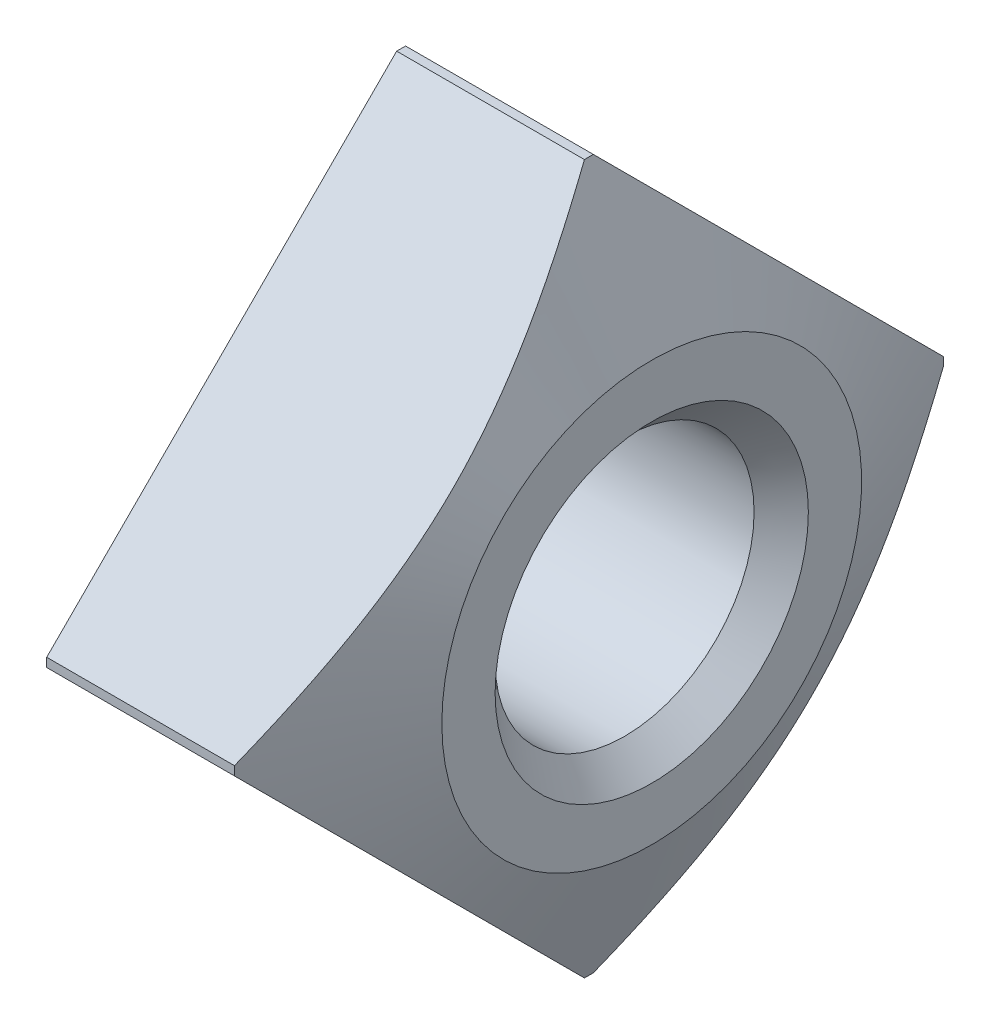
ISO-10303-21;
HEADER;
FILE_DESCRIPTION(('STEP AP214'),'2;1');
FILE_NAME('part.step','',(''),(''),'','','');
FILE_SCHEMA(('AUTOMOTIVE_DESIGN { 1 0 10303 214 1 1 1 1 }'));
ENDSEC;
DATA;
#1=APPLICATION_CONTEXT('core data for automotive mechanical design processes');
#2=APPLICATION_PROTOCOL_DEFINITION('international standard','automotive_design',2000,#1);
#3=PRODUCT_CONTEXT('',#1,'mechanical');
#4=PRODUCT('Part','Part','',(#3));
#5=PRODUCT_RELATED_PRODUCT_CATEGORY('part','',(#4));
#6=PRODUCT_DEFINITION_FORMATION('','',#4);
#7=PRODUCT_DEFINITION_CONTEXT('part definition',#1,'design');
#8=PRODUCT_DEFINITION('design','',#6,#7);
#9=PRODUCT_DEFINITION_SHAPE('','',#8);
#10=(LENGTH_UNIT() NAMED_UNIT(*) SI_UNIT(.MILLI.,.METRE.));
#11=(NAMED_UNIT(*) PLANE_ANGLE_UNIT() SI_UNIT($,.RADIAN.));
#12=(NAMED_UNIT(*) SI_UNIT($,.STERADIAN.) SOLID_ANGLE_UNIT());
#13=UNCERTAINTY_MEASURE_WITH_UNIT(LENGTH_MEASURE(1.E-05),#10,'distance_accuracy_value','');
#14=(GEOMETRIC_REPRESENTATION_CONTEXT(3) GLOBAL_UNCERTAINTY_ASSIGNED_CONTEXT((#13)) GLOBAL_UNIT_ASSIGNED_CONTEXT((#10,
#11,#12)) REPRESENTATION_CONTEXT('',''));
#15=CARTESIAN_POINT('',(0.,0.,0.));
#16=DIRECTION('',(0.,0.,1.));
#17=DIRECTION('',(1.,0.,0.));
#18=AXIS2_PLACEMENT_3D('',#15,#16,#17);
#19=CARTESIAN_POINT('',(4.,0.,0.));
#20=DIRECTION('',(-1.,0.,0.));
#21=DIRECTION('',(0.,0.,1.));
#22=AXIS2_PLACEMENT_3D('',#19,#20,#21);
#23=CYLINDRICAL_SURFACE('',#22,5.6568542494924);
#24=CARTESIAN_POINT('',(2.9969512250895,0.,0.));
#25=DIRECTION('',(-1.,0.,0.));
#26=DIRECTION('',(0.,0.,1.));
#27=AXIS2_PLACEMENT_3D('',#24,#25,#26);
#28=CIRCLE('',#27,5.6568542494924);
#29=CARTESIAN_POINT('',(2.9969512250895,-0.0711582499163105,5.65640667769469));
#30=VERTEX_POINT('',#29);
#31=CARTESIAN_POINT('',(2.9969512250895,0.0711582499163112,5.65640667769469));
#32=VERTEX_POINT('',#31);
#33=EDGE_CURVE('E145',#30,#32,#28,.T.);
#34=ORIENTED_EDGE('',*,*,#33,.T.);
#35=DIRECTION('',(-1.,0.,0.));
#36=VECTOR('',#35,1.);
#37=CARTESIAN_POINT('',(4.,0.0711582499163094,5.65640667769469));
#38=LINE('',#37,#36);
#39=CARTESIAN_POINT('',(0.,0.071158249916309,5.65640667769469));
#40=VERTEX_POINT('',#39);
#41=EDGE_CURVE('E198',#32,#40,#38,.T.);
#42=ORIENTED_EDGE('',*,*,#41,.T.);
#43=CARTESIAN_POINT('',(0.,0.,0.));
#44=DIRECTION('',(-1.,0.,0.));
#45=DIRECTION('',(0.,0.,1.));
#46=AXIS2_PLACEMENT_3D('',#43,#44,#45);
#47=CIRCLE('',#46,5.6568542494924);
#48=CARTESIAN_POINT('',(0.,-0.0711582499163096,5.65640667769469));
#49=VERTEX_POINT('',#48);
#50=EDGE_CURVE('E140',#49,#40,#47,.T.);
#51=ORIENTED_EDGE('',*,*,#50,.F.);
#52=DIRECTION('',(-1.,0.,0.));
#53=VECTOR('',#52,1.);
#54=CARTESIAN_POINT('',(4.,-0.0711582499163094,5.65640667769469));
#55=LINE('',#54,#53);
#56=EDGE_CURVE('E206',#49,#30,#55,.F.);
#57=ORIENTED_EDGE('',*,*,#56,.T.);
#58=EDGE_LOOP('',(#34,#42,#51,#57));
#59=FACE_BOUND('',#58,.T.);
#60=ADVANCED_FACE('F43',(#59),#23,.T.);
#61=CARTESIAN_POINT('',(2.9969512250895,-5.65640667769469,-0.0711582499163105));
#62=VERTEX_POINT('',#61);
#63=CARTESIAN_POINT('',(2.9969512250895,-5.65640667769469,0.0711582499163112));
#64=VERTEX_POINT('',#63);
#65=EDGE_CURVE('E188',#62,#64,#28,.T.);
#66=ORIENTED_EDGE('',*,*,#65,.T.);
#67=DIRECTION('',(-1.,0.,0.));
#68=VECTOR('',#67,1.);
#69=CARTESIAN_POINT('',(4.,-5.65640667769469,0.0711582499163094));
#70=LINE('',#69,#68);
#71=CARTESIAN_POINT('',(0.,-5.65640667769469,0.071158249916309));
#72=VERTEX_POINT('',#71);
#73=EDGE_CURVE('E64',#64,#72,#70,.T.);
#74=ORIENTED_EDGE('',*,*,#73,.T.);
#75=CARTESIAN_POINT('',(0.,-5.65640667769469,-0.0711582499163096));
#76=VERTEX_POINT('',#75);
#77=EDGE_CURVE('E138',#76,#72,#47,.T.);
#78=ORIENTED_EDGE('',*,*,#77,.F.);
#79=DIRECTION('',(-1.,0.,0.));
#80=VECTOR('',#79,1.);
#81=CARTESIAN_POINT('',(4.,-5.65640667769469,-0.0711582499163094));
#82=LINE('',#81,#80);
#83=EDGE_CURVE('E209',#76,#62,#82,.F.);
#84=ORIENTED_EDGE('',*,*,#83,.T.);
#85=EDGE_LOOP('',(#66,#74,#78,#84));
#86=FACE_BOUND('',#85,.T.);
#87=ADVANCED_FACE('F242',(#86),#23,.T.);
#88=CARTESIAN_POINT('',(2.9969512250895,0.0711582499163105,-5.65640667769469));
#89=VERTEX_POINT('',#88);
#90=CARTESIAN_POINT('',(2.9969512250895,-0.0711582499163112,-5.65640667769469));
#91=VERTEX_POINT('',#90);
#92=EDGE_CURVE('E187',#89,#91,#28,.T.);
#93=ORIENTED_EDGE('',*,*,#92,.T.);
#94=DIRECTION('',(-1.,0.,0.));
#95=VECTOR('',#94,1.);
#96=CARTESIAN_POINT('',(4.,-0.0711582499163094,-5.65640667769469));
#97=LINE('',#96,#95);
#98=CARTESIAN_POINT('',(0.,-0.071158249916309,-5.65640667769469));
#99=VERTEX_POINT('',#98);
#100=EDGE_CURVE('E72',#91,#99,#97,.T.);
#101=ORIENTED_EDGE('',*,*,#100,.T.);
#102=CARTESIAN_POINT('',(0.,0.0711582499163096,-5.65640667769469));
#103=VERTEX_POINT('',#102);
#104=EDGE_CURVE('E131',#103,#99,#47,.T.);
#105=ORIENTED_EDGE('',*,*,#104,.F.);
#106=DIRECTION('',(-1.,0.,0.));
#107=VECTOR('',#106,1.);
#108=CARTESIAN_POINT('',(4.,0.0711582499163094,-5.65640667769469));
#109=LINE('',#108,#107);
#110=EDGE_CURVE('E113',#103,#89,#109,.F.);
#111=ORIENTED_EDGE('',*,*,#110,.T.);
#112=EDGE_LOOP('',(#93,#101,#105,#111));
#113=FACE_BOUND('',#112,.T.);
#114=ADVANCED_FACE('F137',(#113),#23,.T.);
#115=CARTESIAN_POINT('',(0.,0.,0.));
#116=DIRECTION('',(1.,0.,0.));
#117=DIRECTION('',(0.,0.,-1.));
#118=AXIS2_PLACEMENT_3D('',#115,#116,#117);
#119=PLANE('',#118);
#120=CARTESIAN_POINT('',(0.,0.,0.));
#121=DIRECTION('',(-1.,0.,0.));
#122=DIRECTION('',(0.,0.,1.));
#123=AXIS2_PLACEMENT_3D('',#120,#121,#122);
#124=CIRCLE('',#123,2.5);
#125=CARTESIAN_POINT('',(0.,0.,2.5));
#126=VERTEX_POINT('',#125);
#127=EDGE_CURVE('E217',#126,#126,#124,.T.);
#128=ORIENTED_EDGE('',*,*,#127,.F.);
#129=EDGE_LOOP('',(#128));
#130=FACE_BOUND('',#129,.T.);
#131=ORIENTED_EDGE('',*,*,#50,.T.);
#132=DIRECTION('',(0.,-0.707106781186548,0.707106781186548));
#133=VECTOR('',#132,1.);
#134=CARTESIAN_POINT('',(0.,5.727564927611,0.));
#135=LINE('',#134,#133);
#136=CARTESIAN_POINT('',(0.,5.65640667769469,0.0711582499163096));
#137=VERTEX_POINT('',#136);
#138=EDGE_CURVE('E215',#137,#40,#135,.T.);
#139=ORIENTED_EDGE('',*,*,#138,.F.);
#140=CARTESIAN_POINT('',(0.,5.65640667769469,-0.071158249916309));
#141=VERTEX_POINT('',#140);
#142=EDGE_CURVE('E134',#137,#141,#47,.T.);
#143=ORIENTED_EDGE('',*,*,#142,.T.);
#144=DIRECTION('',(0.,0.707106781186548,0.707106781186548));
#145=VECTOR('',#144,1.);
#146=CARTESIAN_POINT('',(0.,0.,-5.727564927611));
#147=LINE('',#146,#145);
#148=EDGE_CURVE('E116',#103,#141,#147,.T.);
#149=ORIENTED_EDGE('',*,*,#148,.F.);
#150=ORIENTED_EDGE('',*,*,#104,.T.);
#151=DIRECTION('',(0.,0.707106781186548,-0.707106781186548));
#152=VECTOR('',#151,1.);
#153=CARTESIAN_POINT('',(0.,-5.727564927611,0.));
#154=LINE('',#153,#152);
#155=EDGE_CURVE('E135',#76,#99,#154,.T.);
#156=ORIENTED_EDGE('',*,*,#155,.F.);
#157=ORIENTED_EDGE('',*,*,#77,.T.);
#158=DIRECTION('',(0.,-0.707106781186548,-0.707106781186548));
#159=VECTOR('',#158,1.);
#160=CARTESIAN_POINT('',(0.,0.,5.727564927611));
#161=LINE('',#160,#159);
#162=EDGE_CURVE('E213',#49,#72,#161,.T.);
#163=ORIENTED_EDGE('',*,*,#162,.F.);
#164=EDGE_LOOP('',(#131,#139,#143,#149,#150,#156,#157,#163));
#165=FACE_BOUND('',#164,.T.);
#166=ADVANCED_FACE('F45',(#130,#165),#119,.F.);
#167=ORIENTED_EDGE('',*,*,#142,.F.);
#168=DIRECTION('',(-1.,0.,0.));
#169=VECTOR('',#168,1.);
#170=CARTESIAN_POINT('',(4.,5.65640667769469,0.0711582499163094));
#171=LINE('',#170,#169);
#172=CARTESIAN_POINT('',(2.9969512250895,5.65640667769469,0.0711582499163105));
#173=VERTEX_POINT('',#172);
#174=EDGE_CURVE('E200',#137,#173,#171,.F.);
#175=ORIENTED_EDGE('',*,*,#174,.T.);
#176=CARTESIAN_POINT('',(2.9969512250895,5.65640667769469,-0.0711582499163112));
#177=VERTEX_POINT('',#176);
#178=EDGE_CURVE('E144',#173,#177,#28,.T.);
#179=ORIENTED_EDGE('',*,*,#178,.T.);
#180=DIRECTION('',(-1.,0.,0.));
#181=VECTOR('',#180,1.);
#182=CARTESIAN_POINT('',(4.,5.65640667769469,-0.0711582499163094));
#183=LINE('',#182,#181);
#184=EDGE_CURVE('E124',#177,#141,#183,.T.);
#185=ORIENTED_EDGE('',*,*,#184,.T.);
#186=EDGE_LOOP('',(#167,#175,#179,#185));
#187=FACE_BOUND('',#186,.T.);
#188=ADVANCED_FACE('F243',(#187),#23,.T.);
#189=CARTESIAN_POINT('',(4.,0.,0.));
#190=DIRECTION('',(-1.,0.,0.));
#191=DIRECTION('',(0.,0.,1.));
#192=AXIS2_PLACEMENT_3D('',#189,#190,#191);
#193=CONICAL_SURFACE('',#192,3.35,1.16064395257623);
#194=ORIENTED_EDGE('',*,*,#178,.F.);
#195=CARTESIAN_POINT('',(2.9967512250895,5.65687252332793,0.070692404283066));
#196=CARTESIAN_POINT('',(3.04815610003317,5.53707357547985,0.190491352131148));
#197=CARTESIAN_POINT('',(3.09806790678389,5.41693917093606,0.310625756674938));
#198=CARTESIAN_POINT('',(3.19406203127136,5.17585022127511,0.551714706335886));
#199=CARTESIAN_POINT('',(3.24014256742266,5.05489532258245,0.672669605028545));
#200=CARTESIAN_POINT('',(3.32785305512325,4.81137325286286,0.916191674748142));
#201=CARTESIAN_POINT('',(3.36945360245624,4.68880073438235,1.03876419322865));
#202=CARTESIAN_POINT('',(3.44675752103648,4.44273499107437,1.28482993653663));
#203=CARTESIAN_POINT('',(3.48246158217204,4.31924187572615,1.40832305188485));
#204=CARTESIAN_POINT('',(3.54571574687495,4.07524551982358,1.65231940778742));
#205=CARTESIAN_POINT('',(3.57348827565138,3.95477145228134,1.77279347532966));
#206=CARTESIAN_POINT('',(3.62117839685476,3.71303779453289,2.01452713307811));
#207=CARTESIAN_POINT('',(3.64109607752598,3.59177821316699,2.13578671444401));
#208=CARTESIAN_POINT('',(3.67201509782098,3.3490531768503,2.3785117507607));
#209=CARTESIAN_POINT('',(3.68304330833951,3.22758946295403,2.49997546465697));
#210=CARTESIAN_POINT('',(3.69564386195821,2.98441725461118,2.74314767299982));
#211=CARTESIAN_POINT('',(3.69721664246266,2.86270877174805,2.86485615586295));
#212=CARTESIAN_POINT('',(3.69107458575418,2.62932693622936,3.09823799138164));
#213=CARTESIAN_POINT('',(3.68410555337613,2.51764339122152,3.20992153638948));
#214=CARTESIAN_POINT('',(3.66247203642502,2.29465826955613,3.43290665805487));
#215=CARTESIAN_POINT('',(3.64780743782444,2.183356698583,3.544208229028));
#216=CARTESIAN_POINT('',(3.59315085985838,1.84973815061871,3.87782677699229));
#217=CARTESIAN_POINT('',(3.54251669010606,1.62827392925037,4.09929099836063));
#218=CARTESIAN_POINT('',(3.44971809521995,1.29511691697196,4.43244801063903));
#219=CARTESIAN_POINT('',(3.41534725648814,1.18225562158866,4.54530930602234));
#220=CARTESIAN_POINT('',(3.34190210702859,0.957283095022142,4.77028183258886));
#221=CARTESIAN_POINT('',(3.30282740857889,0.845171926474221,4.88239300113678));
#222=CARTESIAN_POINT('',(3.22102785462997,0.622286456978046,5.10527847063295));
#223=CARTESIAN_POINT('',(3.17832432040565,0.511508193037542,5.21605673457346));
#224=CARTESIAN_POINT('',(3.08975125799081,0.290624355609998,5.436940572001));
#225=CARTESIAN_POINT('',(3.04388278388252,0.180518571325549,5.54704635628545));
#226=CARTESIAN_POINT('',(2.9967512250895,0.0706924042830657,5.65687252332793));
#227=B_SPLINE_CURVE_WITH_KNOTS('',3,(#195,#196,#197,#198,#199,#200,#201,#202,#203,#204,#205,
#206,#207,#208,#209,#210,#211,#212,#213,#214,#215,#216,#217,#218,#219,#220,#221,#222,#223,#224,
#225,#226),.UNSPECIFIED.,.F.,.F.,(4,2,2,2,2,2,2,2,2,2,2,2,2,2,2,4),(0.,0.531168174989741,
1.06258198378602,1.59729471186651,2.13194483421963,2.64966257359643,3.16737449657434,
3.68351556024275,4.1996327472551,4.67372576977668,5.14782581727562,6.09842110234493,
6.58818845486339,7.07799620479323,7.56510240178404,8.05204714404511),.UNSPECIFIED.);
#228=EDGE_CURVE('E11',#173,#32,#227,.T.);
#229=ORIENTED_EDGE('',*,*,#228,.T.);
#230=ORIENTED_EDGE('',*,*,#33,.F.);
#231=CARTESIAN_POINT('',(2.9967512250895,-0.070692404283066,5.65687252332793));
#232=CARTESIAN_POINT('',(3.04815610003317,-0.190491352131148,5.53707357547985));
#233=CARTESIAN_POINT('',(3.09806790678389,-0.310625756674938,5.41693917093606));
#234=CARTESIAN_POINT('',(3.19406203127136,-0.551714706335886,5.17585022127511));
#235=CARTESIAN_POINT('',(3.24014256742266,-0.672669605028545,5.05489532258245));
#236=CARTESIAN_POINT('',(3.32785305512325,-0.916191674748142,4.81137325286286));
#237=CARTESIAN_POINT('',(3.36945360245624,-1.03876419322865,4.68880073438235));
#238=CARTESIAN_POINT('',(3.44675752103648,-1.28482993653663,4.44273499107437));
#239=CARTESIAN_POINT('',(3.48246158217204,-1.40832305188485,4.31924187572615));
#240=CARTESIAN_POINT('',(3.54571574687495,-1.65231940778742,4.07524551982358));
#241=CARTESIAN_POINT('',(3.57348827565138,-1.77279347532966,3.95477145228134));
#242=CARTESIAN_POINT('',(3.62117839685476,-2.01452713307811,3.71303779453289));
#243=CARTESIAN_POINT('',(3.64109607752598,-2.13578671444401,3.59177821316699));
#244=CARTESIAN_POINT('',(3.67201509782098,-2.3785117507607,3.3490531768503));
#245=CARTESIAN_POINT('',(3.68304330833951,-2.49997546465697,3.22758946295403));
#246=CARTESIAN_POINT('',(3.69564386195821,-2.74314767299982,2.98441725461118));
#247=CARTESIAN_POINT('',(3.69721664246266,-2.86485615586295,2.86270877174805));
#248=CARTESIAN_POINT('',(3.69107458575418,-3.09823799138164,2.62932693622936));
#249=CARTESIAN_POINT('',(3.68410555337613,-3.20992153638948,2.51764339122152));
#250=CARTESIAN_POINT('',(3.66247203642502,-3.43290665805487,2.29465826955613));
#251=CARTESIAN_POINT('',(3.64780743782444,-3.544208229028,2.183356698583));
#252=CARTESIAN_POINT('',(3.59315085985838,-3.87782677699229,1.84973815061871));
#253=CARTESIAN_POINT('',(3.54251669010606,-4.09929099836063,1.62827392925037));
#254=CARTESIAN_POINT('',(3.44971809521995,-4.43244801063903,1.29511691697196));
#255=CARTESIAN_POINT('',(3.41534725648814,-4.54530930602234,1.18225562158866));
#256=CARTESIAN_POINT('',(3.34190210702859,-4.77028183258886,0.957283095022142));
#257=CARTESIAN_POINT('',(3.30282740857889,-4.88239300113678,0.845171926474221));
#258=CARTESIAN_POINT('',(3.22102785462997,-5.10527847063295,0.622286456978046));
#259=CARTESIAN_POINT('',(3.17832432040565,-5.21605673457346,0.511508193037542));
#260=CARTESIAN_POINT('',(3.08975125799081,-5.436940572001,0.290624355609998));
#261=CARTESIAN_POINT('',(3.04388278388252,-5.54704635628545,0.180518571325549));
#262=CARTESIAN_POINT('',(2.9967512250895,-5.65687252332793,0.0706924042830657));
#263=B_SPLINE_CURVE_WITH_KNOTS('',3,(#231,#232,#233,#234,#235,#236,#237,#238,#239,#240,#241,
#242,#243,#244,#245,#246,#247,#248,#249,#250,#251,#252,#253,#254,#255,#256,#257,#258,#259,#260,
#261,#262),.UNSPECIFIED.,.F.,.F.,(4,2,2,2,2,2,2,2,2,2,2,2,2,2,2,4),(0.,0.531168174989741,
1.06258198378602,1.59729471186651,2.13194483421963,2.64966257359643,3.16737449657434,
3.68351556024275,4.1996327472551,4.67372576977668,5.14782581727562,6.09842110234493,
6.58818845486339,7.07799620479323,7.56510240178404,8.05204714404511),.UNSPECIFIED.);
#264=EDGE_CURVE('E57',#30,#64,#263,.T.);
#265=ORIENTED_EDGE('',*,*,#264,.T.);
#266=ORIENTED_EDGE('',*,*,#65,.F.);
#267=CARTESIAN_POINT('',(2.9967512250895,-5.65687252332793,-0.070692404283066));
#268=CARTESIAN_POINT('',(3.04815610003317,-5.53707357547985,-0.190491352131148));
#269=CARTESIAN_POINT('',(3.09806790678389,-5.41693917093606,-0.310625756674938));
#270=CARTESIAN_POINT('',(3.19406203127136,-5.17585022127511,-0.551714706335886));
#271=CARTESIAN_POINT('',(3.24014256742266,-5.05489532258245,-0.672669605028545));
#272=CARTESIAN_POINT('',(3.32785305512325,-4.81137325286286,-0.916191674748142));
#273=CARTESIAN_POINT('',(3.36945360245624,-4.68880073438235,-1.03876419322865));
#274=CARTESIAN_POINT('',(3.44675752103648,-4.44273499107437,-1.28482993653663));
#275=CARTESIAN_POINT('',(3.48246158217204,-4.31924187572615,-1.40832305188485));
#276=CARTESIAN_POINT('',(3.54571574687495,-4.07524551982358,-1.65231940778742));
#277=CARTESIAN_POINT('',(3.57348827565138,-3.95477145228134,-1.77279347532966));
#278=CARTESIAN_POINT('',(3.62117839685476,-3.71303779453289,-2.01452713307811));
#279=CARTESIAN_POINT('',(3.64109607752598,-3.59177821316699,-2.13578671444401));
#280=CARTESIAN_POINT('',(3.67201509782098,-3.3490531768503,-2.3785117507607));
#281=CARTESIAN_POINT('',(3.68304330833951,-3.22758946295403,-2.49997546465697));
#282=CARTESIAN_POINT('',(3.69564386195821,-2.98441725461118,-2.74314767299982));
#283=CARTESIAN_POINT('',(3.69721664246266,-2.86270877174805,-2.86485615586295));
#284=CARTESIAN_POINT('',(3.69107458575418,-2.62932693622936,-3.09823799138164));
#285=CARTESIAN_POINT('',(3.68410555337613,-2.51764339122152,-3.20992153638948));
#286=CARTESIAN_POINT('',(3.66247203642502,-2.29465826955613,-3.43290665805487));
#287=CARTESIAN_POINT('',(3.64780743782444,-2.183356698583,-3.544208229028));
#288=CARTESIAN_POINT('',(3.59315085985838,-1.84973815061871,-3.87782677699229));
#289=CARTESIAN_POINT('',(3.54251669010606,-1.62827392925037,-4.09929099836063));
#290=CARTESIAN_POINT('',(3.44971809521995,-1.29511691697196,-4.43244801063903));
#291=CARTESIAN_POINT('',(3.41534725648814,-1.18225562158866,-4.54530930602234));
#292=CARTESIAN_POINT('',(3.34190210702859,-0.957283095022142,-4.77028183258886));
#293=CARTESIAN_POINT('',(3.30282740857889,-0.845171926474221,-4.88239300113678));
#294=CARTESIAN_POINT('',(3.22102785462997,-0.622286456978046,-5.10527847063295));
#295=CARTESIAN_POINT('',(3.17832432040565,-0.511508193037542,-5.21605673457346));
#296=CARTESIAN_POINT('',(3.08975125799081,-0.290624355609998,-5.436940572001));
#297=CARTESIAN_POINT('',(3.04388278388252,-0.180518571325549,-5.54704635628545));
#298=CARTESIAN_POINT('',(2.9967512250895,-0.0706924042830657,-5.65687252332793));
#299=B_SPLINE_CURVE_WITH_KNOTS('',3,(#267,#268,#269,#270,#271,#272,#273,#274,#275,#276,#277,
#278,#279,#280,#281,#282,#283,#284,#285,#286,#287,#288,#289,#290,#291,#292,#293,#294,#295,#296,
#297,#298),.UNSPECIFIED.,.F.,.F.,(4,2,2,2,2,2,2,2,2,2,2,2,2,2,2,4),(0.,0.531168174989741,
1.06258198378602,1.59729471186651,2.13194483421963,2.64966257359643,3.16737449657434,
3.68351556024275,4.1996327472551,4.67372576977668,5.14782581727562,6.09842110234493,
6.58818845486339,7.07799620479323,7.56510240178404,8.05204714404511),.UNSPECIFIED.);
#300=EDGE_CURVE('E153',#62,#91,#299,.T.);
#301=ORIENTED_EDGE('',*,*,#300,.T.);
#302=ORIENTED_EDGE('',*,*,#92,.F.);
#303=CARTESIAN_POINT('',(2.9967512250895,0.070692404283066,-5.65687252332793));
#304=CARTESIAN_POINT('',(3.04815610003317,0.190491352131148,-5.53707357547985));
#305=CARTESIAN_POINT('',(3.09806790678389,0.310625756674938,-5.41693917093606));
#306=CARTESIAN_POINT('',(3.19406203127136,0.551714706335886,-5.17585022127511));
#307=CARTESIAN_POINT('',(3.24014256742266,0.672669605028545,-5.05489532258245));
#308=CARTESIAN_POINT('',(3.32785305512325,0.916191674748142,-4.81137325286286));
#309=CARTESIAN_POINT('',(3.36945360245624,1.03876419322865,-4.68880073438235));
#310=CARTESIAN_POINT('',(3.44675752103648,1.28482993653663,-4.44273499107437));
#311=CARTESIAN_POINT('',(3.48246158217204,1.40832305188485,-4.31924187572615));
#312=CARTESIAN_POINT('',(3.54571574687495,1.65231940778742,-4.07524551982358));
#313=CARTESIAN_POINT('',(3.57348827565138,1.77279347532966,-3.95477145228134));
#314=CARTESIAN_POINT('',(3.62117839685476,2.01452713307811,-3.71303779453289));
#315=CARTESIAN_POINT('',(3.64109607752598,2.13578671444401,-3.59177821316699));
#316=CARTESIAN_POINT('',(3.67201509782098,2.3785117507607,-3.3490531768503));
#317=CARTESIAN_POINT('',(3.68304330833951,2.49997546465697,-3.22758946295403));
#318=CARTESIAN_POINT('',(3.69564386195821,2.74314767299982,-2.98441725461118));
#319=CARTESIAN_POINT('',(3.69721664246266,2.86485615586295,-2.86270877174805));
#320=CARTESIAN_POINT('',(3.69107458575418,3.09823799138164,-2.62932693622936));
#321=CARTESIAN_POINT('',(3.68410555337613,3.20992153638948,-2.51764339122152));
#322=CARTESIAN_POINT('',(3.66247203642502,3.43290665805487,-2.29465826955613));
#323=CARTESIAN_POINT('',(3.64780743782444,3.544208229028,-2.183356698583));
#324=CARTESIAN_POINT('',(3.59315085985838,3.87782677699229,-1.84973815061871));
#325=CARTESIAN_POINT('',(3.54251669010606,4.09929099836063,-1.62827392925037));
#326=CARTESIAN_POINT('',(3.44971809521995,4.43244801063903,-1.29511691697196));
#327=CARTESIAN_POINT('',(3.41534725648814,4.54530930602234,-1.18225562158866));
#328=CARTESIAN_POINT('',(3.34190210702859,4.77028183258886,-0.957283095022142));
#329=CARTESIAN_POINT('',(3.30282740857889,4.88239300113678,-0.845171926474221));
#330=CARTESIAN_POINT('',(3.22102785462997,5.10527847063295,-0.622286456978046));
#331=CARTESIAN_POINT('',(3.17832432040565,5.21605673457346,-0.511508193037542));
#332=CARTESIAN_POINT('',(3.08975125799081,5.436940572001,-0.290624355609998));
#333=CARTESIAN_POINT('',(3.04388278388252,5.54704635628545,-0.180518571325549));
#334=CARTESIAN_POINT('',(2.9967512250895,5.65687252332793,-0.0706924042830657));
#335=B_SPLINE_CURVE_WITH_KNOTS('',3,(#303,#304,#305,#306,#307,#308,#309,#310,#311,#312,#313,
#314,#315,#316,#317,#318,#319,#320,#321,#322,#323,#324,#325,#326,#327,#328,#329,#330,#331,#332,
#333,#334),.UNSPECIFIED.,.F.,.F.,(4,2,2,2,2,2,2,2,2,2,2,2,2,2,2,4),(0.,0.531168174989741,
1.06258198378602,1.59729471186651,2.13194483421963,2.64966257359643,3.16737449657434,
3.68351556024275,4.1996327472551,4.67372576977668,5.14782581727562,6.09842110234493,
6.58818845486339,7.07799620479323,7.56510240178404,8.05204714404511),.UNSPECIFIED.);
#336=EDGE_CURVE('E119',#89,#177,#335,.T.);
#337=ORIENTED_EDGE('',*,*,#336,.T.);
#338=EDGE_LOOP('',(#194,#229,#230,#265,#266,#301,#302,#337));
#339=FACE_BOUND('',#338,.T.);
#340=CARTESIAN_POINT('',(4.,0.,0.));
#341=DIRECTION('',(-1.,0.,0.));
#342=DIRECTION('',(0.,0.,1.));
#343=AXIS2_PLACEMENT_3D('',#340,#341,#342);
#344=CIRCLE('',#343,3.35);
#345=CARTESIAN_POINT('',(4.,0.,3.35));
#346=VERTEX_POINT('',#345);
#347=EDGE_CURVE('E193',#346,#346,#344,.T.);
#348=ORIENTED_EDGE('',*,*,#347,.T.);
#349=EDGE_LOOP('',(#348));
#350=FACE_BOUND('',#349,.T.);
#351=ADVANCED_FACE('F159',(#339,#350),#193,.T.);
#352=CARTESIAN_POINT('',(4.,3.35,0.));
#353=DIRECTION('',(-1.,0.,0.));
#354=DIRECTION('',(0.,0.,1.));
#355=AXIS2_PLACEMENT_3D('',#352,#353,#354);
#356=PLANE('',#355);
#357=CARTESIAN_POINT('',(4.,0.,0.));
#358=DIRECTION('',(-1.,0.,0.));
#359=DIRECTION('',(0.,0.,1.));
#360=AXIS2_PLACEMENT_3D('',#357,#358,#359);
#361=CIRCLE('',#360,2.5);
#362=CARTESIAN_POINT('',(4.,0.,2.5));
#363=VERTEX_POINT('',#362);
#364=EDGE_CURVE('E226',#363,#363,#361,.T.);
#365=ORIENTED_EDGE('',*,*,#364,.T.);
#366=EDGE_LOOP('',(#365));
#367=FACE_BOUND('',#366,.T.);
#368=ORIENTED_EDGE('',*,*,#347,.F.);
#369=EDGE_LOOP('',(#368));
#370=FACE_BOUND('',#369,.T.);
#371=ADVANCED_FACE('F166',(#367,#370),#356,.F.);
#372=CARTESIAN_POINT('',(4.,0.,-5.727564927611));
#373=DIRECTION('',(0.,-0.707106781186547,0.707106781186547));
#374=DIRECTION('',(0.,-0.707106781186548,-0.707106781186548));
#375=AXIS2_PLACEMENT_3D('',#372,#373,#374);
#376=PLANE('',#375);
#377=ORIENTED_EDGE('',*,*,#336,.F.);
#378=ORIENTED_EDGE('',*,*,#110,.F.);
#379=ORIENTED_EDGE('',*,*,#148,.T.);
#380=ORIENTED_EDGE('',*,*,#184,.F.);
#381=EDGE_LOOP('',(#377,#378,#379,#380));
#382=FACE_BOUND('',#381,.T.);
#383=ADVANCED_FACE('F115',(#382),#376,.F.);
#384=CARTESIAN_POINT('',(4.,-5.727564927611,0.));
#385=DIRECTION('',(0.,0.707106781186547,0.707106781186547));
#386=DIRECTION('',(0.,-0.707106781186548,0.707106781186548));
#387=AXIS2_PLACEMENT_3D('',#384,#385,#386);
#388=PLANE('',#387);
#389=ORIENTED_EDGE('',*,*,#300,.F.);
#390=ORIENTED_EDGE('',*,*,#83,.F.);
#391=ORIENTED_EDGE('',*,*,#155,.T.);
#392=ORIENTED_EDGE('',*,*,#100,.F.);
#393=EDGE_LOOP('',(#389,#390,#391,#392));
#394=FACE_BOUND('',#393,.T.);
#395=ADVANCED_FACE('F165',(#394),#388,.F.);
#396=CARTESIAN_POINT('',(4.,0.,5.727564927611));
#397=DIRECTION('',(0.,0.707106781186547,-0.707106781186547));
#398=DIRECTION('',(0.,0.707106781186548,0.707106781186548));
#399=AXIS2_PLACEMENT_3D('',#396,#397,#398);
#400=PLANE('',#399);
#401=ORIENTED_EDGE('',*,*,#264,.F.);
#402=ORIENTED_EDGE('',*,*,#56,.F.);
#403=ORIENTED_EDGE('',*,*,#162,.T.);
#404=ORIENTED_EDGE('',*,*,#73,.F.);
#405=EDGE_LOOP('',(#401,#402,#403,#404));
#406=FACE_BOUND('',#405,.T.);
#407=ADVANCED_FACE('F172',(#406),#400,.F.);
#408=CARTESIAN_POINT('',(4.,5.727564927611,0.));
#409=DIRECTION('',(0.,-0.707106781186547,-0.707106781186547));
#410=DIRECTION('',(0.,0.707106781186548,-0.707106781186548));
#411=AXIS2_PLACEMENT_3D('',#408,#409,#410);
#412=PLANE('',#411);
#413=ORIENTED_EDGE('',*,*,#228,.F.);
#414=ORIENTED_EDGE('',*,*,#174,.F.);
#415=ORIENTED_EDGE('',*,*,#138,.T.);
#416=ORIENTED_EDGE('',*,*,#41,.F.);
#417=EDGE_LOOP('',(#413,#414,#415,#416));
#418=FACE_BOUND('',#417,.T.);
#419=ADVANCED_FACE('F175',(#418),#412,.F.);
#420=CARTESIAN_POINT('',(0.433,0.,0.));
#421=DIRECTION('',(-1.,0.,0.));
#422=DIRECTION('',(0.,0.,1.));
#423=AXIS2_PLACEMENT_3D('',#420,#421,#422);
#424=CONICAL_SURFACE('',#423,2.067,0.785398163397448);
#425=ORIENTED_EDGE('',*,*,#127,.T.);
#426=EDGE_LOOP('',(#425));
#427=FACE_BOUND('',#426,.T.);
#428=CARTESIAN_POINT('',(0.433,0.,0.));
#429=DIRECTION('',(-1.,0.,0.));
#430=DIRECTION('',(0.,0.,1.));
#431=AXIS2_PLACEMENT_3D('',#428,#429,#430);
#432=CIRCLE('',#431,2.067);
#433=CARTESIAN_POINT('',(0.433,0.,2.067));
#434=VERTEX_POINT('',#433);
#435=EDGE_CURVE('E220',#434,#434,#432,.T.);
#436=ORIENTED_EDGE('',*,*,#435,.F.);
#437=EDGE_LOOP('',(#436));
#438=FACE_BOUND('',#437,.T.);
#439=ADVANCED_FACE('F167',(#427,#438),#424,.F.);
#440=CARTESIAN_POINT('',(4.,0.,0.));
#441=DIRECTION('',(-1.,0.,0.));
#442=DIRECTION('',(0.,0.,1.));
#443=AXIS2_PLACEMENT_3D('',#440,#441,#442);
#444=CYLINDRICAL_SURFACE('',#443,2.067);
#445=ORIENTED_EDGE('',*,*,#435,.T.);
#446=EDGE_LOOP('',(#445));
#447=FACE_BOUND('',#446,.T.);
#448=CARTESIAN_POINT('',(3.567,0.,0.));
#449=DIRECTION('',(-1.,0.,0.));
#450=DIRECTION('',(0.,0.,1.));
#451=AXIS2_PLACEMENT_3D('',#448,#449,#450);
#452=CIRCLE('',#451,2.067);
#453=CARTESIAN_POINT('',(3.567,0.,2.067));
#454=VERTEX_POINT('',#453);
#455=EDGE_CURVE('E223',#454,#454,#452,.T.);
#456=ORIENTED_EDGE('',*,*,#455,.F.);
#457=EDGE_LOOP('',(#456));
#458=FACE_BOUND('',#457,.T.);
#459=ADVANCED_FACE('F234',(#447,#458),#444,.F.);
#460=CARTESIAN_POINT('',(4.,0.,0.));
#461=DIRECTION('',(1.,0.,0.));
#462=DIRECTION('',(0.,0.,-1.));
#463=AXIS2_PLACEMENT_3D('',#460,#461,#462);
#464=CONICAL_SURFACE('',#463,2.5,0.785398163397448);
#465=ORIENTED_EDGE('',*,*,#455,.T.);
#466=EDGE_LOOP('',(#465));
#467=FACE_BOUND('',#466,.T.);
#468=ORIENTED_EDGE('',*,*,#364,.F.);
#469=EDGE_LOOP('',(#468));
#470=FACE_BOUND('',#469,.T.);
#471=ADVANCED_FACE('F232',(#467,#470),#464,.F.);
#472=CLOSED_SHELL('',(#60,#87,#114,#166,#188,#351,#371,#383,#395,#407,#419,#439,#459,#471));
#473=MANIFOLD_SOLID_BREP('B2',#472);
#474=ADVANCED_BREP_SHAPE_REPRESENTATION('',(#18,#473),#14);
#475=SHAPE_DEFINITION_REPRESENTATION(#9,#474);
ENDSEC;
END-ISO-10303-21;
